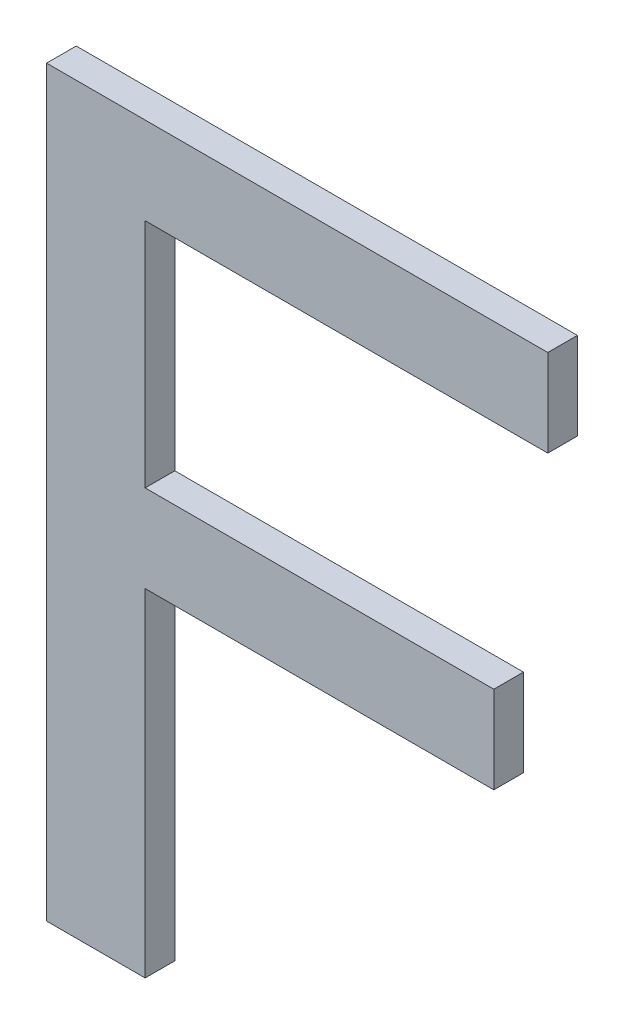
ISO-10303-21;
HEADER;
FILE_DESCRIPTION(('STEP AP214'),'2;1');
FILE_NAME('part.step','',(''),(''),'','','');
FILE_SCHEMA(('AUTOMOTIVE_DESIGN { 1 0 10303 214 1 1 1 1 }'));
ENDSEC;
DATA;
#1=APPLICATION_CONTEXT('core data for automotive mechanical design processes');
#2=APPLICATION_PROTOCOL_DEFINITION('international standard','automotive_design',2000,#1);
#3=PRODUCT_CONTEXT('',#1,'mechanical');
#4=PRODUCT('Part','Part','',(#3));
#5=PRODUCT_RELATED_PRODUCT_CATEGORY('part','',(#4));
#6=PRODUCT_DEFINITION_FORMATION('','',#4);
#7=PRODUCT_DEFINITION_CONTEXT('part definition',#1,'design');
#8=PRODUCT_DEFINITION('design','',#6,#7);
#9=PRODUCT_DEFINITION_SHAPE('','',#8);
#10=(LENGTH_UNIT() NAMED_UNIT(*) SI_UNIT(.MILLI.,.METRE.));
#11=(NAMED_UNIT(*) PLANE_ANGLE_UNIT() SI_UNIT($,.RADIAN.));
#12=(NAMED_UNIT(*) SI_UNIT($,.STERADIAN.) SOLID_ANGLE_UNIT());
#13=UNCERTAINTY_MEASURE_WITH_UNIT(LENGTH_MEASURE(1.E-05),#10,'distance_accuracy_value','');
#14=(GEOMETRIC_REPRESENTATION_CONTEXT(3) GLOBAL_UNCERTAINTY_ASSIGNED_CONTEXT((#13)) GLOBAL_UNIT_ASSIGNED_CONTEXT((#10,
#11,#12)) REPRESENTATION_CONTEXT('',''));
#15=CARTESIAN_POINT('',(0.,0.,0.));
#16=DIRECTION('',(0.,0.,1.));
#17=DIRECTION('',(1.,0.,0.));
#18=AXIS2_PLACEMENT_3D('',#15,#16,#17);
#19=CARTESIAN_POINT('',(-0.195855568732,0.03025579472864,1.59999999404));
#20=DIRECTION('',(0.,0.,1.));
#21=DIRECTION('',(1.,0.,0.));
#22=AXIS2_PLACEMENT_3D('',#19,#20,#21);
#23=PLANE('',#22);
#24=DIRECTION('',(0.,1.,0.));
#25=VECTOR('',#24,1.);
#26=CARTESIAN_POINT('',(-0.252222891524,0.08671433125564,1.59999999404));
#27=LINE('',#26,#25);
#28=CARTESIAN_POINT('',(-0.252222891524,0.164764330536,1.59999999404));
#29=VERTEX_POINT('',#28);
#30=CARTESIAN_POINT('',(-0.252222891524,0.00866433197516003,1.59999999404));
#31=VERTEX_POINT('',#30);
#32=EDGE_CURVE('E126',#29,#31,#27,.F.);
#33=ORIENTED_EDGE('',*,*,#32,.F.);
#34=DIRECTION('',(1.,0.,0.));
#35=VECTOR('',#34,1.);
#36=CARTESIAN_POINT('',(-0.116422893864,0.164764330536,1.59999999404));
#37=LINE('',#36,#35);
#38=CARTESIAN_POINT('',(0.01937710379716,0.164764330536,1.59999999404));
#39=VERTEX_POINT('',#38);
#40=EDGE_CURVE('E130',#39,#29,#37,.F.);
#41=ORIENTED_EDGE('',*,*,#40,.F.);
#42=DIRECTION('',(0.,1.,0.));
#43=VECTOR('',#42,1.);
#44=CARTESIAN_POINT('',(0.01937710379716,0.194164329953,1.59999999404));
#45=LINE('',#44,#43);
#46=CARTESIAN_POINT('',(0.01937710379716,0.223564329371,1.59999999404));
#47=VERTEX_POINT('',#46);
#48=EDGE_CURVE('E134',#47,#39,#45,.F.);
#49=ORIENTED_EDGE('',*,*,#48,.F.);
#50=DIRECTION('',(1.,0.,0.));
#51=VECTOR('',#50,1.);
#52=CARTESIAN_POINT('',(-0.149672900245,0.223564329371,1.59999999404));
#53=LINE('',#52,#51);
#54=CARTESIAN_POINT('',(-0.318722904287,0.223564329371,1.59999999404));
#55=VERTEX_POINT('',#54);
#56=EDGE_CURVE('E138',#55,#47,#53,.T.);
#57=ORIENTED_EDGE('',*,*,#56,.F.);
#58=DIRECTION('',(0.,1.,0.));
#59=VECTOR('',#58,1.);
#60=CARTESIAN_POINT('',(-0.318722904287,-0.0270356701687,1.59999999404));
#61=LINE('',#60,#59);
#62=CARTESIAN_POINT('',(-0.318722904287,-0.277635669708,1.59999999404));
#63=VERTEX_POINT('',#62);
#64=EDGE_CURVE('E107',#63,#55,#61,.T.);
#65=ORIENTED_EDGE('',*,*,#64,.F.);
#66=DIRECTION('',(1.,0.,0.));
#67=VECTOR('',#66,1.);
#68=CARTESIAN_POINT('',(-0.285472897906,-0.277635669708,1.59999999404));
#69=LINE('',#68,#67);
#70=CARTESIAN_POINT('',(-0.252222891524,-0.277635669708,1.59999999404));
#71=VERTEX_POINT('',#70);
#72=EDGE_CURVE('E20',#71,#63,#69,.F.);
#73=ORIENTED_EDGE('',*,*,#72,.F.);
#74=DIRECTION('',(0.,1.,0.));
#75=VECTOR('',#74,1.);
#76=CARTESIAN_POINT('',(-0.252222891524,-0.163885670132,1.59999999404));
#77=LINE('',#76,#75);
#78=CARTESIAN_POINT('',(-0.252222891524,-0.05013567055576,1.59999999404));
#79=VERTEX_POINT('',#78);
#80=EDGE_CURVE('E95',#79,#71,#77,.F.);
#81=ORIENTED_EDGE('',*,*,#80,.F.);
#82=DIRECTION('',(1.,0.,0.));
#83=VECTOR('',#82,1.);
#84=CARTESIAN_POINT('',(-0.134622893855,-0.05013567055576,1.59999999404));
#85=LINE('',#84,#83);
#86=CARTESIAN_POINT('',(-0.01702289618552,-0.05013567055576,1.59999999404));
#87=VERTEX_POINT('',#86);
#88=EDGE_CURVE('E90',#87,#79,#85,.F.);
#89=ORIENTED_EDGE('',*,*,#88,.F.);
#90=DIRECTION('',(0.,1.,0.));
#91=VECTOR('',#90,1.);
#92=CARTESIAN_POINT('',(-0.01702289618552,-0.0207356692903,1.59999999404));
#93=LINE('',#92,#91);
#94=CARTESIAN_POINT('',(-0.01702289618552,0.00866433197516,1.59999999404));
#95=VERTEX_POINT('',#94);
#96=EDGE_CURVE('E118',#95,#87,#93,.F.);
#97=ORIENTED_EDGE('',*,*,#96,.F.);
#98=DIRECTION('',(1.,0.,0.));
#99=VECTOR('',#98,1.);
#100=CARTESIAN_POINT('',(-0.134622893855,0.00866433197515999,1.59999999404));
#101=LINE('',#100,#99);
#102=EDGE_CURVE('E122',#31,#95,#101,.T.);
#103=ORIENTED_EDGE('',*,*,#102,.F.);
#104=EDGE_LOOP('',(#33,#41,#49,#57,#65,#73,#81,#89,#97,#103));
#105=FACE_BOUND('',#104,.T.);
#106=ADVANCED_FACE('F17',(#105),#23,.T.);
#107=CARTESIAN_POINT('',(-0.285472897906,-0.277635669708,1.59999999404));
#108=DIRECTION('',(0.,-1.,0.));
#109=DIRECTION('',(0.,0.,-1.));
#110=AXIS2_PLACEMENT_3D('',#107,#108,#109);
#111=PLANE('',#110);
#112=DIRECTION('',(1.,0.,0.));
#113=VECTOR('',#112,1.);
#114=CARTESIAN_POINT('',(-0.195855568732,-0.277635669708,1.57999999404));
#115=LINE('',#114,#113);
#116=CARTESIAN_POINT('',(-0.318722904287,-0.277635669708,1.57999999404));
#117=VERTEX_POINT('',#116);
#118=CARTESIAN_POINT('',(-0.252222891524,-0.277635669708,1.57999999404));
#119=VERTEX_POINT('',#118);
#120=EDGE_CURVE('E113',#117,#119,#115,.T.);
#121=ORIENTED_EDGE('',*,*,#120,.T.);
#122=DIRECTION('',(0.,0.,-1.));
#123=VECTOR('',#122,1.);
#124=CARTESIAN_POINT('',(-0.252222891524,-0.277635669708,1.59999999404));
#125=LINE('',#124,#123);
#126=EDGE_CURVE('E100',#71,#119,#125,.T.);
#127=ORIENTED_EDGE('',*,*,#126,.F.);
#128=ORIENTED_EDGE('',*,*,#72,.T.);
#129=DIRECTION('',(0.,0.,1.));
#130=VECTOR('',#129,1.);
#131=CARTESIAN_POINT('',(-0.318722904287,-0.277635669708,1.59999999404));
#132=LINE('',#131,#130);
#133=EDGE_CURVE('E144',#117,#63,#132,.T.);
#134=ORIENTED_EDGE('',*,*,#133,.F.);
#135=EDGE_LOOP('',(#121,#127,#128,#134));
#136=FACE_BOUND('',#135,.T.);
#137=ADVANCED_FACE('F112',(#136),#111,.T.);
#138=CARTESIAN_POINT('',(-0.252222891524,-0.163885670132,1.59999999404));
#139=DIRECTION('',(1.,0.,0.));
#140=DIRECTION('',(0.,0.,-1.));
#141=AXIS2_PLACEMENT_3D('',#138,#139,#140);
#142=PLANE('',#141);
#143=DIRECTION('',(0.,1.,0.));
#144=VECTOR('',#143,1.);
#145=CARTESIAN_POINT('',(-0.252222891524,0.03025579472864,1.57999999404));
#146=LINE('',#145,#144);
#147=CARTESIAN_POINT('',(-0.252222891524,-0.05013567055576,1.57999999404));
#148=VERTEX_POINT('',#147);
#149=EDGE_CURVE('E147',#119,#148,#146,.T.);
#150=ORIENTED_EDGE('',*,*,#149,.T.);
#151=DIRECTION('',(0.,0.,-1.));
#152=VECTOR('',#151,1.);
#153=CARTESIAN_POINT('',(-0.252222891524,-0.05013567055576,1.59999999404));
#154=LINE('',#153,#152);
#155=EDGE_CURVE('E102',#79,#148,#154,.T.);
#156=ORIENTED_EDGE('',*,*,#155,.F.);
#157=ORIENTED_EDGE('',*,*,#80,.T.);
#158=ORIENTED_EDGE('',*,*,#126,.T.);
#159=EDGE_LOOP('',(#150,#156,#157,#158));
#160=FACE_BOUND('',#159,.T.);
#161=ADVANCED_FACE('F98',(#160),#142,.T.);
#162=CARTESIAN_POINT('',(-0.134622893855,-0.05013567055576,1.59999999404));
#163=DIRECTION('',(0.,-1.,0.));
#164=DIRECTION('',(0.,0.,-1.));
#165=AXIS2_PLACEMENT_3D('',#162,#163,#164);
#166=PLANE('',#165);
#167=DIRECTION('',(1.,0.,0.));
#168=VECTOR('',#167,1.);
#169=CARTESIAN_POINT('',(-0.195855568732,-0.05013567055576,1.57999999404));
#170=LINE('',#169,#168);
#171=CARTESIAN_POINT('',(-0.01702289618552,-0.05013567055576,1.57999999404));
#172=VERTEX_POINT('',#171);
#173=EDGE_CURVE('E149',#148,#172,#170,.T.);
#174=ORIENTED_EDGE('',*,*,#173,.T.);
#175=DIRECTION('',(0.,0.,-1.));
#176=VECTOR('',#175,1.);
#177=CARTESIAN_POINT('',(-0.01702289618552,-0.05013567055576,1.59999999404));
#178=LINE('',#177,#176);
#179=EDGE_CURVE('E120',#87,#172,#178,.T.);
#180=ORIENTED_EDGE('',*,*,#179,.F.);
#181=ORIENTED_EDGE('',*,*,#88,.T.);
#182=ORIENTED_EDGE('',*,*,#155,.T.);
#183=EDGE_LOOP('',(#174,#180,#181,#182));
#184=FACE_BOUND('',#183,.T.);
#185=ADVANCED_FACE('F198',(#184),#166,.T.);
#186=CARTESIAN_POINT('',(-0.01702289618552,-0.0207356692903,1.59999999404));
#187=DIRECTION('',(1.,0.,0.));
#188=DIRECTION('',(0.,0.,-1.));
#189=AXIS2_PLACEMENT_3D('',#186,#187,#188);
#190=PLANE('',#189);
#191=DIRECTION('',(0.,1.,0.));
#192=VECTOR('',#191,1.);
#193=CARTESIAN_POINT('',(-0.01702289618552,0.03025579472864,1.57999999404));
#194=LINE('',#193,#192);
#195=CARTESIAN_POINT('',(-0.01702289618552,0.00866433197516,1.57999999404));
#196=VERTEX_POINT('',#195);
#197=EDGE_CURVE('E152',#172,#196,#194,.T.);
#198=ORIENTED_EDGE('',*,*,#197,.T.);
#199=DIRECTION('',(0.,0.,1.));
#200=VECTOR('',#199,1.);
#201=CARTESIAN_POINT('',(-0.01702289618552,0.00866433197516,1.59999999404));
#202=LINE('',#201,#200);
#203=EDGE_CURVE('E124',#95,#196,#202,.F.);
#204=ORIENTED_EDGE('',*,*,#203,.F.);
#205=ORIENTED_EDGE('',*,*,#96,.T.);
#206=ORIENTED_EDGE('',*,*,#179,.T.);
#207=EDGE_LOOP('',(#198,#204,#205,#206));
#208=FACE_BOUND('',#207,.T.);
#209=ADVANCED_FACE('F197',(#208),#190,.T.);
#210=CARTESIAN_POINT('',(-0.134622893855,0.00866433197515999,1.59999999404));
#211=DIRECTION('',(0.,1.,0.));
#212=DIRECTION('',(0.,0.,1.));
#213=AXIS2_PLACEMENT_3D('',#210,#211,#212);
#214=PLANE('',#213);
#215=DIRECTION('',(1.,0.,0.));
#216=VECTOR('',#215,1.);
#217=CARTESIAN_POINT('',(-0.195855568732,0.00866433197516002,1.57999999404));
#218=LINE('',#217,#216);
#219=CARTESIAN_POINT('',(-0.252222891524,0.00866433197516003,1.57999999404));
#220=VERTEX_POINT('',#219);
#221=EDGE_CURVE('E155',#196,#220,#218,.F.);
#222=ORIENTED_EDGE('',*,*,#221,.T.);
#223=DIRECTION('',(0.,0.,-1.));
#224=VECTOR('',#223,1.);
#225=CARTESIAN_POINT('',(-0.252222891524,0.00866433197516003,1.59999999404));
#226=LINE('',#225,#224);
#227=EDGE_CURVE('E128',#31,#220,#226,.T.);
#228=ORIENTED_EDGE('',*,*,#227,.F.);
#229=ORIENTED_EDGE('',*,*,#102,.T.);
#230=ORIENTED_EDGE('',*,*,#203,.T.);
#231=EDGE_LOOP('',(#222,#228,#229,#230));
#232=FACE_BOUND('',#231,.T.);
#233=ADVANCED_FACE('F191',(#232),#214,.T.);
#234=CARTESIAN_POINT('',(-0.252222891524,0.08671433125564,1.59999999404));
#235=DIRECTION('',(1.,0.,0.));
#236=DIRECTION('',(0.,0.,-1.));
#237=AXIS2_PLACEMENT_3D('',#234,#235,#236);
#238=PLANE('',#237);
#239=DIRECTION('',(0.,1.,0.));
#240=VECTOR('',#239,1.);
#241=CARTESIAN_POINT('',(-0.252222891524,0.03025579472864,1.57999999404));
#242=LINE('',#241,#240);
#243=CARTESIAN_POINT('',(-0.252222891524,0.164764330536,1.57999999404));
#244=VERTEX_POINT('',#243);
#245=EDGE_CURVE('E158',#220,#244,#242,.T.);
#246=ORIENTED_EDGE('',*,*,#245,.T.);
#247=DIRECTION('',(0.,0.,-1.));
#248=VECTOR('',#247,1.);
#249=CARTESIAN_POINT('',(-0.252222891524,0.164764330536,1.59999999404));
#250=LINE('',#249,#248);
#251=EDGE_CURVE('E132',#29,#244,#250,.T.);
#252=ORIENTED_EDGE('',*,*,#251,.F.);
#253=ORIENTED_EDGE('',*,*,#32,.T.);
#254=ORIENTED_EDGE('',*,*,#227,.T.);
#255=EDGE_LOOP('',(#246,#252,#253,#254));
#256=FACE_BOUND('',#255,.T.);
#257=ADVANCED_FACE('F187',(#256),#238,.T.);
#258=CARTESIAN_POINT('',(-0.116422893864,0.164764330536,1.59999999404));
#259=DIRECTION('',(0.,-1.,0.));
#260=DIRECTION('',(0.,0.,-1.));
#261=AXIS2_PLACEMENT_3D('',#258,#259,#260);
#262=PLANE('',#261);
#263=DIRECTION('',(1.,0.,0.));
#264=VECTOR('',#263,1.);
#265=CARTESIAN_POINT('',(-0.195855568732,0.164764330536,1.57999999404));
#266=LINE('',#265,#264);
#267=CARTESIAN_POINT('',(0.01937710379716,0.164764330536,1.57999999404));
#268=VERTEX_POINT('',#267);
#269=EDGE_CURVE('E161',#244,#268,#266,.T.);
#270=ORIENTED_EDGE('',*,*,#269,.T.);
#271=DIRECTION('',(0.,0.,-1.));
#272=VECTOR('',#271,1.);
#273=CARTESIAN_POINT('',(0.01937710379716,0.164764330536,1.59999999404));
#274=LINE('',#273,#272);
#275=EDGE_CURVE('E136',#39,#268,#274,.T.);
#276=ORIENTED_EDGE('',*,*,#275,.F.);
#277=ORIENTED_EDGE('',*,*,#40,.T.);
#278=ORIENTED_EDGE('',*,*,#251,.T.);
#279=EDGE_LOOP('',(#270,#276,#277,#278));
#280=FACE_BOUND('',#279,.T.);
#281=ADVANCED_FACE('F182',(#280),#262,.T.);
#282=CARTESIAN_POINT('',(0.01937710379716,0.194164329953,1.59999999404));
#283=DIRECTION('',(1.,0.,0.));
#284=DIRECTION('',(0.,0.,-1.));
#285=AXIS2_PLACEMENT_3D('',#282,#283,#284);
#286=PLANE('',#285);
#287=DIRECTION('',(0.,1.,0.));
#288=VECTOR('',#287,1.);
#289=CARTESIAN_POINT('',(0.01937710379716,0.03025579472864,1.57999999404));
#290=LINE('',#289,#288);
#291=CARTESIAN_POINT('',(0.01937710379716,0.223564329371,1.57999999404));
#292=VERTEX_POINT('',#291);
#293=EDGE_CURVE('E164',#268,#292,#290,.T.);
#294=ORIENTED_EDGE('',*,*,#293,.T.);
#295=DIRECTION('',(0.,0.,1.));
#296=VECTOR('',#295,1.);
#297=CARTESIAN_POINT('',(0.01937710379716,0.223564329371,1.59999999404));
#298=LINE('',#297,#296);
#299=EDGE_CURVE('E140',#47,#292,#298,.F.);
#300=ORIENTED_EDGE('',*,*,#299,.F.);
#301=ORIENTED_EDGE('',*,*,#48,.T.);
#302=ORIENTED_EDGE('',*,*,#275,.T.);
#303=EDGE_LOOP('',(#294,#300,#301,#302));
#304=FACE_BOUND('',#303,.T.);
#305=ADVANCED_FACE('F177',(#304),#286,.T.);
#306=CARTESIAN_POINT('',(-0.149672900245,0.223564329371,1.59999999404));
#307=DIRECTION('',(0.,1.,0.));
#308=DIRECTION('',(0.,0.,1.));
#309=AXIS2_PLACEMENT_3D('',#306,#307,#308);
#310=PLANE('',#309);
#311=DIRECTION('',(1.,0.,0.));
#312=VECTOR('',#311,1.);
#313=CARTESIAN_POINT('',(-0.195855568732,0.223564329371,1.57999999404));
#314=LINE('',#313,#312);
#315=CARTESIAN_POINT('',(-0.318722904287,0.223564329371,1.57999999404));
#316=VERTEX_POINT('',#315);
#317=EDGE_CURVE('E26',#292,#316,#314,.F.);
#318=ORIENTED_EDGE('',*,*,#317,.T.);
#319=DIRECTION('',(0.,0.,1.));
#320=VECTOR('',#319,1.);
#321=CARTESIAN_POINT('',(-0.318722904287,0.223564329371,1.59999999404));
#322=LINE('',#321,#320);
#323=EDGE_CURVE('E34',#55,#316,#322,.F.);
#324=ORIENTED_EDGE('',*,*,#323,.F.);
#325=ORIENTED_EDGE('',*,*,#56,.T.);
#326=ORIENTED_EDGE('',*,*,#299,.T.);
#327=EDGE_LOOP('',(#318,#324,#325,#326));
#328=FACE_BOUND('',#327,.T.);
#329=ADVANCED_FACE('F170',(#328),#310,.T.);
#330=CARTESIAN_POINT('',(-0.318722904287,-0.0270356701687,1.59999999404));
#331=DIRECTION('',(-1.,0.,0.));
#332=DIRECTION('',(0.,0.,1.));
#333=AXIS2_PLACEMENT_3D('',#330,#331,#332);
#334=PLANE('',#333);
#335=DIRECTION('',(0.,1.,0.));
#336=VECTOR('',#335,1.);
#337=CARTESIAN_POINT('',(-0.318722904287,0.03025579472864,1.57999999404));
#338=LINE('',#337,#336);
#339=EDGE_CURVE('E11',#316,#117,#338,.F.);
#340=ORIENTED_EDGE('',*,*,#339,.T.);
#341=ORIENTED_EDGE('',*,*,#133,.T.);
#342=ORIENTED_EDGE('',*,*,#64,.T.);
#343=ORIENTED_EDGE('',*,*,#323,.T.);
#344=EDGE_LOOP('',(#340,#341,#342,#343));
#345=FACE_BOUND('',#344,.T.);
#346=ADVANCED_FACE('F199',(#345),#334,.T.);
#347=CARTESIAN_POINT('',(-0.195855568732,0.03025579472864,1.57999999404));
#348=DIRECTION('',(0.,0.,1.));
#349=DIRECTION('',(1.,0.,0.));
#350=AXIS2_PLACEMENT_3D('',#347,#348,#349);
#351=PLANE('',#350);
#352=ORIENTED_EDGE('',*,*,#317,.F.);
#353=ORIENTED_EDGE('',*,*,#293,.F.);
#354=ORIENTED_EDGE('',*,*,#269,.F.);
#355=ORIENTED_EDGE('',*,*,#245,.F.);
#356=ORIENTED_EDGE('',*,*,#221,.F.);
#357=ORIENTED_EDGE('',*,*,#197,.F.);
#358=ORIENTED_EDGE('',*,*,#173,.F.);
#359=ORIENTED_EDGE('',*,*,#149,.F.);
#360=ORIENTED_EDGE('',*,*,#120,.F.);
#361=ORIENTED_EDGE('',*,*,#339,.F.);
#362=EDGE_LOOP('',(#352,#353,#354,#355,#356,#357,#358,#359,#360,#361));
#363=FACE_BOUND('',#362,.T.);
#364=ADVANCED_FACE('F174',(#363),#351,.F.);
#365=CLOSED_SHELL('',(#106,#137,#161,#185,#209,#233,#257,#281,#305,#329,#346,#364));
#366=MANIFOLD_SOLID_BREP('B1',#365);
#367=ADVANCED_BREP_SHAPE_REPRESENTATION('',(#18,#366),#14);
#368=SHAPE_DEFINITION_REPRESENTATION(#9,#367);
ENDSEC;
END-ISO-10303-21;
